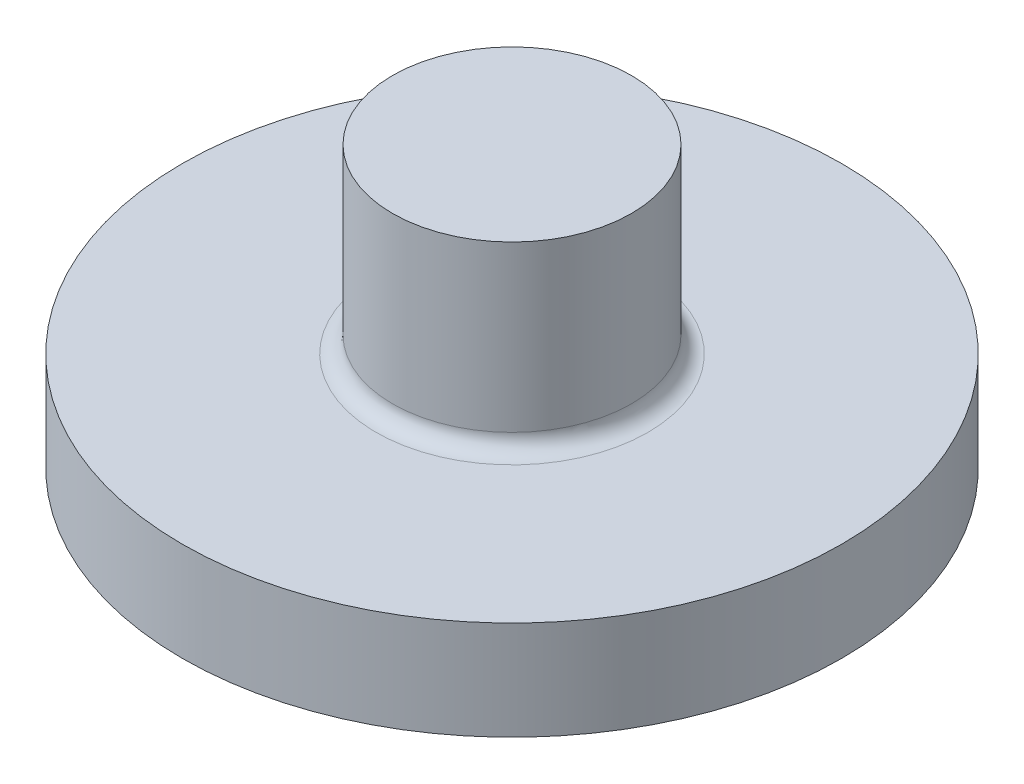
ISO-10303-21;
HEADER;
FILE_DESCRIPTION(('STEP AP214'),'2;1');
FILE_NAME('part.step','',(''),(''),'','','');
FILE_SCHEMA(('AUTOMOTIVE_DESIGN { 1 0 10303 214 1 1 1 1 }'));
ENDSEC;
DATA;
#1=APPLICATION_CONTEXT('core data for automotive mechanical design processes');
#2=APPLICATION_PROTOCOL_DEFINITION('international standard','automotive_design',2000,#1);
#3=PRODUCT_CONTEXT('',#1,'mechanical');
#4=PRODUCT('Part','Part','',(#3));
#5=PRODUCT_RELATED_PRODUCT_CATEGORY('part','',(#4));
#6=PRODUCT_DEFINITION_FORMATION('','',#4);
#7=PRODUCT_DEFINITION_CONTEXT('part definition',#1,'design');
#8=PRODUCT_DEFINITION('design','',#6,#7);
#9=PRODUCT_DEFINITION_SHAPE('','',#8);
#10=(LENGTH_UNIT() NAMED_UNIT(*) SI_UNIT(.MILLI.,.METRE.));
#11=(NAMED_UNIT(*) PLANE_ANGLE_UNIT() SI_UNIT($,.RADIAN.));
#12=(NAMED_UNIT(*) SI_UNIT($,.STERADIAN.) SOLID_ANGLE_UNIT());
#13=UNCERTAINTY_MEASURE_WITH_UNIT(LENGTH_MEASURE(1.E-05),#10,'distance_accuracy_value','');
#14=(GEOMETRIC_REPRESENTATION_CONTEXT(3) GLOBAL_UNCERTAINTY_ASSIGNED_CONTEXT((#13)) GLOBAL_UNIT_ASSIGNED_CONTEXT((#10,
#11,#12)) REPRESENTATION_CONTEXT('',''));
#15=CARTESIAN_POINT('',(0.,0.,0.));
#16=DIRECTION('',(0.,0.,1.));
#17=DIRECTION('',(1.,0.,0.));
#18=AXIS2_PLACEMENT_3D('',#15,#16,#17);
#19=CARTESIAN_POINT('',(0.,1.7,0.));
#20=DIRECTION('',(0.,-1.,0.));
#21=DIRECTION('',(1.,0.,0.));
#22=AXIS2_PLACEMENT_3D('',#19,#20,#21);
#23=PLANE('',#22);
#24=CARTESIAN_POINT('',(0.,1.7,0.));
#25=DIRECTION('',(0.,1.,0.));
#26=DIRECTION('',(-1.,0.,0.));
#27=AXIS2_PLACEMENT_3D('',#24,#25,#26);
#28=CIRCLE('',#27,0.724999999999998);
#29=CARTESIAN_POINT('',(-0.724999999999991,1.7,0.));
#30=VERTEX_POINT('',#29);
#31=EDGE_CURVE('E45',#30,#30,#28,.T.);
#32=ORIENTED_EDGE('',*,*,#31,.T.);
#33=EDGE_LOOP('',(#32));
#34=FACE_BOUND('',#33,.T.);
#35=ADVANCED_FACE('F34',(#34),#23,.F.);
#36=CARTESIAN_POINT('',(0.,48.1816943228477,0.));
#37=DIRECTION('',(0.,1.,0.));
#38=DIRECTION('',(-1.,0.,0.));
#39=AXIS2_PLACEMENT_3D('',#36,#37,#38);
#40=CYLINDRICAL_SURFACE('',#39,0.724999999999998);
#41=CARTESIAN_POINT('',(0.,0.699999999999999,0.));
#42=DIRECTION('',(0.,-1.,0.));
#43=DIRECTION('',(1.,0.,0.));
#44=AXIS2_PLACEMENT_3D('',#41,#42,#43);
#45=CIRCLE('',#44,0.724999999999998);
#46=CARTESIAN_POINT('',(0.725000000000006,0.699999999999999,0.));
#47=VERTEX_POINT('',#46);
#48=EDGE_CURVE('E41',#47,#47,#45,.F.);
#49=ORIENTED_EDGE('',*,*,#48,.T.);
#50=EDGE_LOOP('',(#49));
#51=FACE_BOUND('',#50,.T.);
#52=ORIENTED_EDGE('',*,*,#31,.F.);
#53=EDGE_LOOP('',(#52));
#54=FACE_BOUND('',#53,.T.);
#55=ADVANCED_FACE('F72',(#51,#54),#40,.T.);
#56=CARTESIAN_POINT('',(0.725000000000006,0.6,0.));
#57=DIRECTION('',(0.,-1.,0.));
#58=DIRECTION('',(1.,0.,0.));
#59=AXIS2_PLACEMENT_3D('',#56,#57,#58);
#60=PLANE('',#59);
#61=CARTESIAN_POINT('',(0.,0.6,0.));
#62=DIRECTION('',(0.,-1.,0.));
#63=DIRECTION('',(1.,0.,0.));
#64=AXIS2_PLACEMENT_3D('',#61,#62,#63);
#65=CIRCLE('',#64,0.824999999999998);
#66=CARTESIAN_POINT('',(0.825000000000006,0.6,0.));
#67=VERTEX_POINT('',#66);
#68=EDGE_CURVE('E10',#67,#67,#65,.T.);
#69=ORIENTED_EDGE('',*,*,#68,.T.);
#70=EDGE_LOOP('',(#69));
#71=FACE_BOUND('',#70,.T.);
#72=CARTESIAN_POINT('',(0.,0.600000000000003,0.));
#73=DIRECTION('',(0.,1.,0.));
#74=DIRECTION('',(-1.,0.,0.));
#75=AXIS2_PLACEMENT_3D('',#72,#73,#74);
#76=CIRCLE('',#75,2.);
#77=CARTESIAN_POINT('',(-1.99999999999999,0.600000000000003,0.));
#78=VERTEX_POINT('',#77);
#79=EDGE_CURVE('E49',#78,#78,#76,.T.);
#80=ORIENTED_EDGE('',*,*,#79,.T.);
#81=EDGE_LOOP('',(#80));
#82=FACE_BOUND('',#81,.T.);
#83=ADVANCED_FACE('F68',(#71,#82),#60,.F.);
#84=CARTESIAN_POINT('',(0.,48.1816943228477,0.));
#85=DIRECTION('',(0.,1.,0.));
#86=DIRECTION('',(-1.,0.,0.));
#87=AXIS2_PLACEMENT_3D('',#84,#85,#86);
#88=CYLINDRICAL_SURFACE('',#87,2.);
#89=ORIENTED_EDGE('',*,*,#79,.F.);
#90=EDGE_LOOP('',(#89));
#91=FACE_BOUND('',#90,.T.);
#92=CARTESIAN_POINT('',(0.,0.,0.));
#93=DIRECTION('',(0.,1.,0.));
#94=DIRECTION('',(-1.,0.,0.));
#95=AXIS2_PLACEMENT_3D('',#92,#93,#94);
#96=CIRCLE('',#95,2.);
#97=CARTESIAN_POINT('',(-1.99999999999999,0.,0.));
#98=VERTEX_POINT('',#97);
#99=EDGE_CURVE('E54',#98,#98,#96,.T.);
#100=ORIENTED_EDGE('',*,*,#99,.T.);
#101=EDGE_LOOP('',(#100));
#102=FACE_BOUND('',#101,.T.);
#103=ADVANCED_FACE('F58',(#91,#102),#88,.T.);
#104=CARTESIAN_POINT('',(2.00000000000001,0.,0.));
#105=DIRECTION('',(0.,1.,0.));
#106=DIRECTION('',(-1.,0.,0.));
#107=AXIS2_PLACEMENT_3D('',#104,#105,#106);
#108=PLANE('',#107);
#109=ORIENTED_EDGE('',*,*,#99,.F.);
#110=EDGE_LOOP('',(#109));
#111=FACE_BOUND('',#110,.T.);
#112=ADVANCED_FACE('F60',(#111),#108,.F.);
#113=CARTESIAN_POINT('',(0.,0.699999999999999,0.));
#114=DIRECTION('',(0.,-1.,0.));
#115=DIRECTION('',(1.,0.,0.));
#116=AXIS2_PLACEMENT_3D('',#113,#114,#115);
#117=TOROIDAL_SURFACE('',#116,0.824999999999998,0.1);
#118=ORIENTED_EDGE('',*,*,#68,.F.);
#119=EDGE_LOOP('',(#118));
#120=FACE_BOUND('',#119,.T.);
#121=ORIENTED_EDGE('',*,*,#48,.F.);
#122=EDGE_LOOP('',(#121));
#123=FACE_BOUND('',#122,.T.);
#124=ADVANCED_FACE('F36',(#120,#123),#117,.F.);
#125=CLOSED_SHELL('',(#35,#55,#83,#103,#112,#124));
#126=MANIFOLD_SOLID_BREP('B2',#125);
#127=ADVANCED_BREP_SHAPE_REPRESENTATION('',(#18,#126),#14);
#128=SHAPE_DEFINITION_REPRESENTATION(#9,#127);
ENDSEC;
END-ISO-10303-21;
